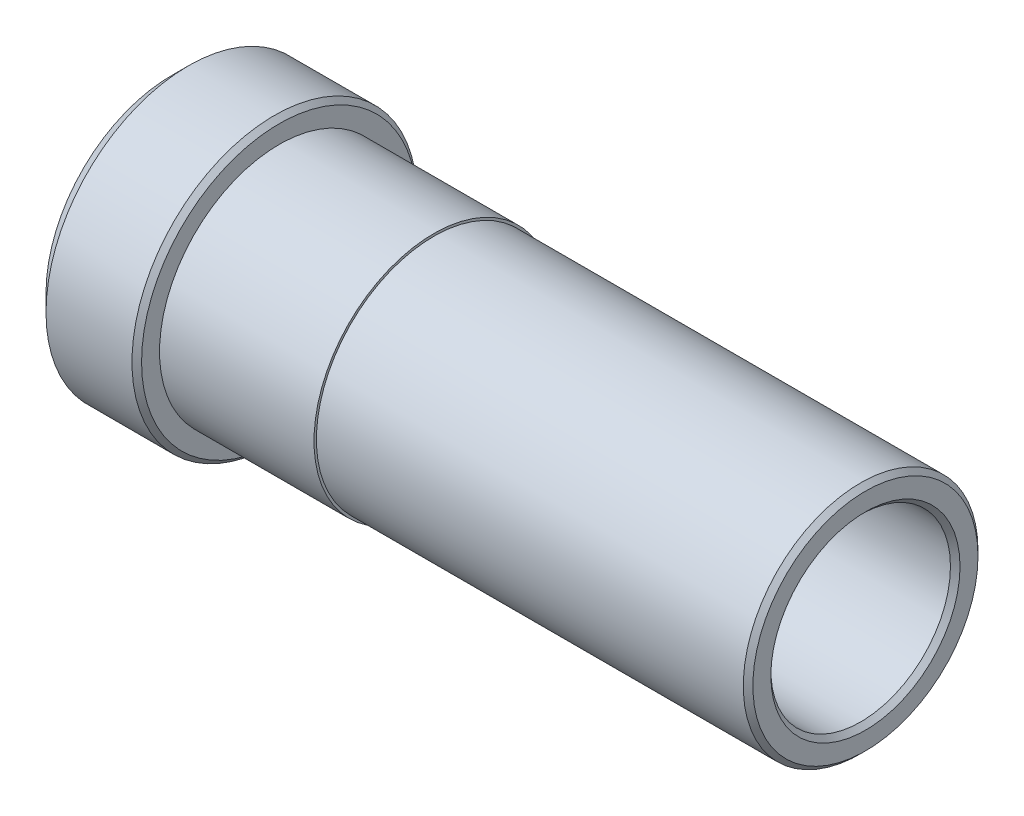
ISO-10303-21;
HEADER;
FILE_DESCRIPTION(('STEP AP214'),'2;1');
FILE_NAME('part.step','',(''),(''),'','','');
FILE_SCHEMA(('AUTOMOTIVE_DESIGN { 1 0 10303 214 1 1 1 1 }'));
ENDSEC;
DATA;
#1=APPLICATION_CONTEXT('core data for automotive mechanical design processes');
#2=APPLICATION_PROTOCOL_DEFINITION('international standard','automotive_design',2000,#1);
#3=PRODUCT_CONTEXT('',#1,'mechanical');
#4=PRODUCT('Part','Part','',(#3));
#5=PRODUCT_RELATED_PRODUCT_CATEGORY('part','',(#4));
#6=PRODUCT_DEFINITION_FORMATION('','',#4);
#7=PRODUCT_DEFINITION_CONTEXT('part definition',#1,'design');
#8=PRODUCT_DEFINITION('design','',#6,#7);
#9=PRODUCT_DEFINITION_SHAPE('','',#8);
#10=(LENGTH_UNIT() NAMED_UNIT(*) SI_UNIT(.MILLI.,.METRE.));
#11=(NAMED_UNIT(*) PLANE_ANGLE_UNIT() SI_UNIT($,.RADIAN.));
#12=(NAMED_UNIT(*) SI_UNIT($,.STERADIAN.) SOLID_ANGLE_UNIT());
#13=UNCERTAINTY_MEASURE_WITH_UNIT(LENGTH_MEASURE(1.E-05),#10,'distance_accuracy_value','');
#14=(GEOMETRIC_REPRESENTATION_CONTEXT(3) GLOBAL_UNCERTAINTY_ASSIGNED_CONTEXT((#13)) GLOBAL_UNIT_ASSIGNED_CONTEXT((#10,
#11,#12)) REPRESENTATION_CONTEXT('',''));
#15=CARTESIAN_POINT('',(0.,0.,0.));
#16=DIRECTION('',(0.,0.,1.));
#17=DIRECTION('',(1.,0.,0.));
#18=AXIS2_PLACEMENT_3D('',#15,#16,#17);
#19=CARTESIAN_POINT('',(0.0635,6.223,0.));
#20=DIRECTION('',(1.,0.,0.));
#21=DIRECTION('',(0.,1.,0.));
#22=AXIS2_PLACEMENT_3D('',#19,#20,#21);
#23=PLANE('',#22);
#24=CARTESIAN_POINT('',(0.0635,0.,0.));
#25=DIRECTION('',(-1.,0.,0.));
#26=DIRECTION('',(0.,0.,-1.));
#27=AXIS2_PLACEMENT_3D('',#24,#25,#26);
#28=CIRCLE('',#27,5.0165);
#29=CARTESIAN_POINT('',(0.0635,0.,-5.0165));
#30=VERTEX_POINT('',#29);
#31=EDGE_CURVE('E126',#30,#30,#28,.T.);
#32=ORIENTED_EDGE('',*,*,#31,.T.);
#33=EDGE_LOOP('',(#32));
#34=FACE_BOUND('',#33,.T.);
#35=CARTESIAN_POINT('',(0.0635,0.,0.));
#36=DIRECTION('',(1.,0.,0.));
#37=DIRECTION('',(0.,0.,-1.));
#38=AXIS2_PLACEMENT_3D('',#35,#36,#37);
#39=CIRCLE('',#38,5.969);
#40=CARTESIAN_POINT('',(0.0635,0.,-5.969));
#41=VERTEX_POINT('',#40);
#42=EDGE_CURVE('E111',#41,#41,#39,.T.);
#43=ORIENTED_EDGE('',*,*,#42,.T.);
#44=EDGE_LOOP('',(#43));
#45=FACE_BOUND('',#44,.T.);
#46=ADVANCED_FACE('F14',(#34,#45),#23,.T.);
#47=CARTESIAN_POINT('',(-36.72205,4.7625,0.));
#48=DIRECTION('',(-1.,0.,0.));
#49=DIRECTION('',(0.,0.,1.));
#50=AXIS2_PLACEMENT_3D('',#47,#48,#49);
#51=PLANE('',#50);
#52=CARTESIAN_POINT('',(-36.72205,0.,0.));
#53=DIRECTION('',(1.,0.,0.));
#54=DIRECTION('',(0.,0.,1.));
#55=AXIS2_PLACEMENT_3D('',#52,#53,#54);
#56=CIRCLE('',#55,5.0165);
#57=CARTESIAN_POINT('',(-36.72205,0.,5.0165));
#58=VERTEX_POINT('',#57);
#59=EDGE_CURVE('E110',#58,#58,#56,.T.);
#60=ORIENTED_EDGE('',*,*,#59,.T.);
#61=EDGE_LOOP('',(#60));
#62=FACE_BOUND('',#61,.T.);
#63=CARTESIAN_POINT('',(-36.72205,0.,0.));
#64=DIRECTION('',(-1.,0.,0.));
#65=DIRECTION('',(0.,0.,1.));
#66=AXIS2_PLACEMENT_3D('',#63,#64,#65);
#67=CIRCLE('',#66,6.6675);
#68=CARTESIAN_POINT('',(-36.72205,0.,6.6675));
#69=VERTEX_POINT('',#68);
#70=EDGE_CURVE('E34',#69,#69,#67,.T.);
#71=ORIENTED_EDGE('',*,*,#70,.T.);
#72=EDGE_LOOP('',(#71));
#73=FACE_BOUND('',#72,.T.);
#74=ADVANCED_FACE('F16',(#62,#73),#51,.T.);
#75=CARTESIAN_POINT('',(-31.01975,7.5565,0.));
#76=DIRECTION('',(1.,0.,0.));
#77=DIRECTION('',(0.,1.,0.));
#78=AXIS2_PLACEMENT_3D('',#75,#76,#77);
#79=PLANE('',#78);
#80=CARTESIAN_POINT('',(-31.01975,0.,0.));
#81=DIRECTION('',(1.,0.,0.));
#82=DIRECTION('',(0.,0.,-1.));
#83=AXIS2_PLACEMENT_3D('',#80,#81,#82);
#84=CIRCLE('',#83,6.35);
#85=CARTESIAN_POINT('',(-31.01975,0.,-6.35));
#86=VERTEX_POINT('',#85);
#87=EDGE_CURVE('E18',#86,#86,#84,.T.);
#88=ORIENTED_EDGE('',*,*,#87,.F.);
#89=EDGE_LOOP('',(#88));
#90=FACE_BOUND('',#89,.T.);
#91=CARTESIAN_POINT('',(-31.01975,0.,0.));
#92=DIRECTION('',(1.,0.,0.));
#93=DIRECTION('',(0.,0.,-1.));
#94=AXIS2_PLACEMENT_3D('',#91,#92,#93);
#95=CIRCLE('',#94,7.3025);
#96=CARTESIAN_POINT('',(-31.01975,0.,-7.3025));
#97=VERTEX_POINT('',#96);
#98=EDGE_CURVE('E117',#97,#97,#95,.T.);
#99=ORIENTED_EDGE('',*,*,#98,.T.);
#100=EDGE_LOOP('',(#99));
#101=FACE_BOUND('',#100,.T.);
#102=ADVANCED_FACE('F51',(#90,#101),#79,.T.);
#103=CARTESIAN_POINT('',(-22.82825,6.35,0.));
#104=DIRECTION('',(1.,0.,0.));
#105=DIRECTION('',(0.,1.,0.));
#106=AXIS2_PLACEMENT_3D('',#103,#104,#105);
#107=PLANE('',#106);
#108=CARTESIAN_POINT('',(-22.82825,0.,0.));
#109=DIRECTION('',(1.,0.,0.));
#110=DIRECTION('',(0.,0.,-1.));
#111=AXIS2_PLACEMENT_3D('',#108,#109,#110);
#112=CIRCLE('',#111,6.223);
#113=CARTESIAN_POINT('',(-22.82825,0.,-6.223));
#114=VERTEX_POINT('',#113);
#115=EDGE_CURVE('E32',#114,#114,#112,.T.);
#116=ORIENTED_EDGE('',*,*,#115,.F.);
#117=EDGE_LOOP('',(#116));
#118=FACE_BOUND('',#117,.T.);
#119=CARTESIAN_POINT('',(-22.82825,0.,0.));
#120=DIRECTION('',(1.,0.,0.));
#121=DIRECTION('',(0.,0.,-1.));
#122=AXIS2_PLACEMENT_3D('',#119,#120,#121);
#123=CIRCLE('',#122,6.35);
#124=CARTESIAN_POINT('',(-22.82825,0.,-6.35));
#125=VERTEX_POINT('',#124);
#126=EDGE_CURVE('E10',#125,#125,#123,.T.);
#127=ORIENTED_EDGE('',*,*,#126,.T.);
#128=EDGE_LOOP('',(#127));
#129=FACE_BOUND('',#128,.T.);
#130=ADVANCED_FACE('F48',(#118,#129),#107,.T.);
#131=CARTESIAN_POINT('',(0.,0.,0.));
#132=DIRECTION('',(1.,0.,0.));
#133=DIRECTION('',(0.,0.,-1.));
#134=AXIS2_PLACEMENT_3D('',#131,#132,#133);
#135=CYLINDRICAL_SURFACE('',#134,6.35);
#136=ORIENTED_EDGE('',*,*,#126,.F.);
#137=EDGE_LOOP('',(#136));
#138=FACE_BOUND('',#137,.T.);
#139=ORIENTED_EDGE('',*,*,#87,.T.);
#140=EDGE_LOOP('',(#139));
#141=FACE_BOUND('',#140,.T.);
#142=ADVANCED_FACE('F49',(#138,#141),#135,.T.);
#143=CARTESIAN_POINT('',(0.,0.,0.));
#144=DIRECTION('',(1.,0.,0.));
#145=DIRECTION('',(0.,0.,-1.));
#146=AXIS2_PLACEMENT_3D('',#143,#144,#145);
#147=CYLINDRICAL_SURFACE('',#146,7.5565);
#148=CARTESIAN_POINT('',(-31.27375,0.,0.));
#149=DIRECTION('',(-1.,0.,0.));
#150=DIRECTION('',(0.,0.,-1.));
#151=AXIS2_PLACEMENT_3D('',#148,#149,#150);
#152=CIRCLE('',#151,7.5565);
#153=CARTESIAN_POINT('',(-31.27375,0.,-7.5565));
#154=VERTEX_POINT('',#153);
#155=EDGE_CURVE('E107',#154,#154,#152,.T.);
#156=ORIENTED_EDGE('',*,*,#155,.T.);
#157=EDGE_LOOP('',(#156));
#158=FACE_BOUND('',#157,.T.);
#159=CARTESIAN_POINT('',(-35.83305,0.,0.));
#160=DIRECTION('',(1.,0.,0.));
#161=DIRECTION('',(0.,0.,1.));
#162=AXIS2_PLACEMENT_3D('',#159,#160,#161);
#163=CIRCLE('',#162,7.5565);
#164=CARTESIAN_POINT('',(-35.83305,0.,7.5565));
#165=VERTEX_POINT('',#164);
#166=EDGE_CURVE('E40',#165,#165,#163,.T.);
#167=ORIENTED_EDGE('',*,*,#166,.T.);
#168=EDGE_LOOP('',(#167));
#169=FACE_BOUND('',#168,.T.);
#170=ADVANCED_FACE('F59',(#158,#169),#147,.T.);
#171=CARTESIAN_POINT('',(0.,0.,0.));
#172=DIRECTION('',(1.,0.,0.));
#173=DIRECTION('',(0.,0.,-1.));
#174=AXIS2_PLACEMENT_3D('',#171,#172,#173);
#175=CYLINDRICAL_SURFACE('',#174,4.7625);
#176=CARTESIAN_POINT('',(-0.1905,0.,0.));
#177=DIRECTION('',(1.,0.,0.));
#178=DIRECTION('',(0.,0.,-1.));
#179=AXIS2_PLACEMENT_3D('',#176,#177,#178);
#180=CIRCLE('',#179,4.7625);
#181=CARTESIAN_POINT('',(-0.1905,0.,-4.7625));
#182=VERTEX_POINT('',#181);
#183=EDGE_CURVE('E101',#182,#182,#180,.T.);
#184=ORIENTED_EDGE('',*,*,#183,.T.);
#185=EDGE_LOOP('',(#184));
#186=FACE_BOUND('',#185,.T.);
#187=CARTESIAN_POINT('',(-36.46805,0.,0.));
#188=DIRECTION('',(-1.,0.,0.));
#189=DIRECTION('',(0.,0.,1.));
#190=AXIS2_PLACEMENT_3D('',#187,#188,#189);
#191=CIRCLE('',#190,4.7625);
#192=CARTESIAN_POINT('',(-36.46805,0.,4.7625));
#193=VERTEX_POINT('',#192);
#194=EDGE_CURVE('E102',#193,#193,#191,.T.);
#195=ORIENTED_EDGE('',*,*,#194,.T.);
#196=EDGE_LOOP('',(#195));
#197=FACE_BOUND('',#196,.T.);
#198=ADVANCED_FACE('F90',(#186,#197),#175,.F.);
#199=CARTESIAN_POINT('',(0.,0.,0.));
#200=DIRECTION('',(1.,0.,0.));
#201=DIRECTION('',(0.,0.,-1.));
#202=AXIS2_PLACEMENT_3D('',#199,#200,#201);
#203=CYLINDRICAL_SURFACE('',#202,6.223);
#204=CARTESIAN_POINT('',(-0.1905,0.,0.));
#205=DIRECTION('',(-1.,0.,0.));
#206=DIRECTION('',(0.,0.,-1.));
#207=AXIS2_PLACEMENT_3D('',#204,#205,#206);
#208=CIRCLE('',#207,6.223);
#209=CARTESIAN_POINT('',(-0.1905,0.,-6.223));
#210=VERTEX_POINT('',#209);
#211=EDGE_CURVE('E120',#210,#210,#208,.T.);
#212=ORIENTED_EDGE('',*,*,#211,.T.);
#213=EDGE_LOOP('',(#212));
#214=FACE_BOUND('',#213,.T.);
#215=ORIENTED_EDGE('',*,*,#115,.T.);
#216=EDGE_LOOP('',(#215));
#217=FACE_BOUND('',#216,.T.);
#218=ADVANCED_FACE('F46',(#214,#217),#203,.T.);
#219=CARTESIAN_POINT('',(-35.83305,0.,0.));
#220=DIRECTION('',(1.,0.,0.));
#221=DIRECTION('',(0.,0.,-1.));
#222=AXIS2_PLACEMENT_3D('',#219,#220,#221);
#223=CONICAL_SURFACE('',#222,7.5565,0.785398163397449);
#224=ORIENTED_EDGE('',*,*,#166,.F.);
#225=EDGE_LOOP('',(#224));
#226=FACE_BOUND('',#225,.T.);
#227=ORIENTED_EDGE('',*,*,#70,.F.);
#228=EDGE_LOOP('',(#227));
#229=FACE_BOUND('',#228,.T.);
#230=ADVANCED_FACE('F85',(#226,#229),#223,.T.);
#231=CARTESIAN_POINT('',(0.0635,0.,0.));
#232=DIRECTION('',(-1.,0.,0.));
#233=DIRECTION('',(0.,0.,1.));
#234=AXIS2_PLACEMENT_3D('',#231,#232,#233);
#235=CONICAL_SURFACE('',#234,5.969,0.78539816339744);
#236=ORIENTED_EDGE('',*,*,#211,.F.);
#237=EDGE_LOOP('',(#236));
#238=FACE_BOUND('',#237,.T.);
#239=ORIENTED_EDGE('',*,*,#42,.F.);
#240=EDGE_LOOP('',(#239));
#241=FACE_BOUND('',#240,.T.);
#242=ADVANCED_FACE('F77',(#238,#241),#235,.T.);
#243=CARTESIAN_POINT('',(-36.72205,0.,0.));
#244=DIRECTION('',(-1.,0.,0.));
#245=DIRECTION('',(0.,0.,1.));
#246=AXIS2_PLACEMENT_3D('',#243,#244,#245);
#247=CONICAL_SURFACE('',#246,5.0165,0.785398163397465);
#248=ORIENTED_EDGE('',*,*,#59,.F.);
#249=EDGE_LOOP('',(#248));
#250=FACE_BOUND('',#249,.T.);
#251=ORIENTED_EDGE('',*,*,#194,.F.);
#252=EDGE_LOOP('',(#251));
#253=FACE_BOUND('',#252,.T.);
#254=ADVANCED_FACE('F74',(#250,#253),#247,.F.);
#255=CARTESIAN_POINT('',(-31.01975,0.,0.));
#256=DIRECTION('',(-1.,0.,0.));
#257=DIRECTION('',(0.,0.,1.));
#258=AXIS2_PLACEMENT_3D('',#255,#256,#257);
#259=CONICAL_SURFACE('',#258,7.3025,0.78539816339745);
#260=ORIENTED_EDGE('',*,*,#155,.F.);
#261=EDGE_LOOP('',(#260));
#262=FACE_BOUND('',#261,.T.);
#263=ORIENTED_EDGE('',*,*,#98,.F.);
#264=EDGE_LOOP('',(#263));
#265=FACE_BOUND('',#264,.T.);
#266=ADVANCED_FACE('F72',(#262,#265),#259,.T.);
#267=CARTESIAN_POINT('',(-0.1905,0.,0.));
#268=DIRECTION('',(1.,0.,0.));
#269=DIRECTION('',(0.,0.,-1.));
#270=AXIS2_PLACEMENT_3D('',#267,#268,#269);
#271=CONICAL_SURFACE('',#270,4.7625,0.785398163397448);
#272=ORIENTED_EDGE('',*,*,#31,.F.);
#273=EDGE_LOOP('',(#272));
#274=FACE_BOUND('',#273,.T.);
#275=ORIENTED_EDGE('',*,*,#183,.F.);
#276=EDGE_LOOP('',(#275));
#277=FACE_BOUND('',#276,.T.);
#278=ADVANCED_FACE('F139',(#274,#277),#271,.F.);
#279=CLOSED_SHELL('',(#46,#74,#102,#130,#142,#170,#198,#218,#230,#242,#254,#266,#278));
#280=MANIFOLD_SOLID_BREP('B1',#279);
#281=ADVANCED_BREP_SHAPE_REPRESENTATION('',(#18,#280),#14);
#282=SHAPE_DEFINITION_REPRESENTATION(#9,#281);
ENDSEC;
END-ISO-10303-21;
